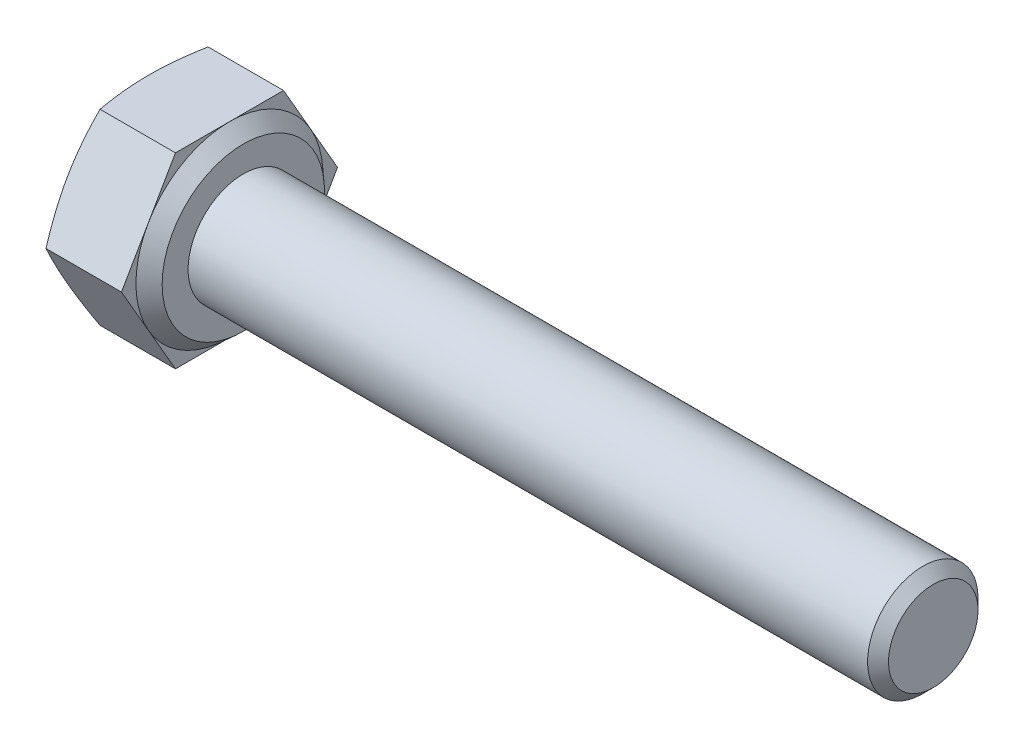
ISO-10303-21;
HEADER;
FILE_DESCRIPTION(('STEP AP214'),'2;1');
FILE_NAME('part.step','',(''),(''),'','','');
FILE_SCHEMA(('AUTOMOTIVE_DESIGN { 1 0 10303 214 1 1 1 1 }'));
ENDSEC;
DATA;
#1=APPLICATION_CONTEXT('core data for automotive mechanical design processes');
#2=APPLICATION_PROTOCOL_DEFINITION('international standard','automotive_design',2000,#1);
#3=PRODUCT_CONTEXT('',#1,'mechanical');
#4=PRODUCT('Part','Part','',(#3));
#5=PRODUCT_RELATED_PRODUCT_CATEGORY('part','',(#4));
#6=PRODUCT_DEFINITION_FORMATION('','',#4);
#7=PRODUCT_DEFINITION_CONTEXT('part definition',#1,'design');
#8=PRODUCT_DEFINITION('design','',#6,#7);
#9=PRODUCT_DEFINITION_SHAPE('','',#8);
#10=(LENGTH_UNIT() NAMED_UNIT(*) SI_UNIT(.MILLI.,.METRE.));
#11=(NAMED_UNIT(*) PLANE_ANGLE_UNIT() SI_UNIT($,.RADIAN.));
#12=(NAMED_UNIT(*) SI_UNIT($,.STERADIAN.) SOLID_ANGLE_UNIT());
#13=UNCERTAINTY_MEASURE_WITH_UNIT(LENGTH_MEASURE(1.E-05),#10,'distance_accuracy_value','');
#14=(GEOMETRIC_REPRESENTATION_CONTEXT(3) GLOBAL_UNCERTAINTY_ASSIGNED_CONTEXT((#13)) GLOBAL_UNIT_ASSIGNED_CONTEXT((#10,
#11,#12)) REPRESENTATION_CONTEXT('',''));
#15=CARTESIAN_POINT('',(0.,0.,0.));
#16=DIRECTION('',(0.,0.,1.));
#17=DIRECTION('',(1.,0.,0.));
#18=AXIS2_PLACEMENT_3D('',#15,#16,#17);
#19=CARTESIAN_POINT('',(3.425,0.,0.));
#20=DIRECTION('',(1.,0.,0.));
#21=DIRECTION('',(0.,0.,-1.));
#22=AXIS2_PLACEMENT_3D('',#19,#20,#21);
#23=PLANE('',#22);
#24=CARTESIAN_POINT('',(3.425,0.,0.));
#25=DIRECTION('',(-1.,0.,0.));
#26=DIRECTION('',(0.,0.,1.));
#27=AXIS2_PLACEMENT_3D('',#24,#25,#26);
#28=CIRCLE('',#27,2.94);
#29=CARTESIAN_POINT('',(3.425,0.,2.94));
#30=VERTEX_POINT('',#29);
#31=EDGE_CURVE('E140',#30,#30,#28,.T.);
#32=ORIENTED_EDGE('',*,*,#31,.F.);
#33=EDGE_LOOP('',(#32));
#34=FACE_BOUND('',#33,.T.);
#35=CARTESIAN_POINT('',(3.425,0.,0.));
#36=DIRECTION('',(1.,0.,0.));
#37=DIRECTION('',(0.,0.,-1.));
#38=AXIS2_PLACEMENT_3D('',#35,#36,#37);
#39=CIRCLE('',#38,2.);
#40=CARTESIAN_POINT('',(3.425,0.,-2.));
#41=VERTEX_POINT('',#40);
#42=EDGE_CURVE('E141',#41,#41,#39,.T.);
#43=ORIENTED_EDGE('',*,*,#42,.F.);
#44=EDGE_LOOP('',(#43));
#45=FACE_BOUND('',#44,.T.);
#46=ADVANCED_FACE('F36',(#34,#45),#23,.T.);
#47=CARTESIAN_POINT('',(2.925,0.,-3.91443482510566));
#48=DIRECTION('',(1.,0.,0.));
#49=DIRECTION('',(0.,0.,-1.));
#50=AXIS2_PLACEMENT_3D('',#47,#48,#49);
#51=PLANE('',#50);
#52=DIRECTION('',(0.,-0.866025403784439,0.5));
#53=VECTOR('',#52,1.);
#54=CARTESIAN_POINT('',(2.925,3.39,1.95721741255283));
#55=LINE('',#54,#53);
#56=CARTESIAN_POINT('',(2.925,3.39,1.95721741255283));
#57=VERTEX_POINT('',#56);
#58=CARTESIAN_POINT('',(2.925,1.695,2.93582611882925));
#59=VERTEX_POINT('',#58);
#60=EDGE_CURVE('E139',#57,#59,#55,.T.);
#61=ORIENTED_EDGE('',*,*,#60,.T.);
#62=CARTESIAN_POINT('',(2.925,0.,0.));
#63=DIRECTION('',(-1.,0.,0.));
#64=DIRECTION('',(0.,0.,1.));
#65=AXIS2_PLACEMENT_3D('',#62,#63,#64);
#66=CIRCLE('',#65,3.39);
#67=CARTESIAN_POINT('',(2.925,3.39,0.));
#68=VERTEX_POINT('',#67);
#69=EDGE_CURVE('E51',#59,#68,#66,.T.);
#70=ORIENTED_EDGE('',*,*,#69,.T.);
#71=DIRECTION('',(0.,0.,1.));
#72=VECTOR('',#71,1.);
#73=CARTESIAN_POINT('',(2.925,3.39,-1.95721741255283));
#74=LINE('',#73,#72);
#75=EDGE_CURVE('E136',#68,#57,#74,.T.);
#76=ORIENTED_EDGE('',*,*,#75,.T.);
#77=EDGE_LOOP('',(#61,#70,#76));
#78=FACE_BOUND('',#77,.T.);
#79=ADVANCED_FACE('F135',(#78),#51,.T.);
#80=CARTESIAN_POINT('',(2.925,3.39,-1.95721741255283));
#81=VERTEX_POINT('',#80);
#82=EDGE_CURVE('E147',#81,#68,#74,.T.);
#83=ORIENTED_EDGE('',*,*,#82,.T.);
#84=CARTESIAN_POINT('',(2.925,1.695,-2.93582611882924));
#85=VERTEX_POINT('',#84);
#86=EDGE_CURVE('E124',#68,#85,#66,.T.);
#87=ORIENTED_EDGE('',*,*,#86,.T.);
#88=DIRECTION('',(0.,0.866025403784438,0.5));
#89=VECTOR('',#88,1.);
#90=CARTESIAN_POINT('',(2.925,0.,-3.91443482510566));
#91=LINE('',#90,#89);
#92=EDGE_CURVE('E153',#85,#81,#91,.T.);
#93=ORIENTED_EDGE('',*,*,#92,.T.);
#94=EDGE_LOOP('',(#83,#87,#93));
#95=FACE_BOUND('',#94,.T.);
#96=ADVANCED_FACE('F152',(#95),#51,.T.);
#97=CARTESIAN_POINT('',(2.925,0.,-3.91443482510566));
#98=VERTEX_POINT('',#97);
#99=EDGE_CURVE('E150',#98,#85,#91,.T.);
#100=ORIENTED_EDGE('',*,*,#99,.T.);
#101=CARTESIAN_POINT('',(2.925,-1.695,-2.93582611882924));
#102=VERTEX_POINT('',#101);
#103=EDGE_CURVE('E127',#85,#102,#66,.T.);
#104=ORIENTED_EDGE('',*,*,#103,.T.);
#105=DIRECTION('',(0.,0.866025403784439,-0.5));
#106=VECTOR('',#105,1.);
#107=CARTESIAN_POINT('',(2.925,-3.39,-1.95721741255283));
#108=LINE('',#107,#106);
#109=EDGE_CURVE('E298',#102,#98,#108,.T.);
#110=ORIENTED_EDGE('',*,*,#109,.T.);
#111=EDGE_LOOP('',(#100,#104,#110));
#112=FACE_BOUND('',#111,.T.);
#113=ADVANCED_FACE('F442',(#112),#51,.T.);
#114=CARTESIAN_POINT('',(2.925,-3.39,-1.95721741255283));
#115=VERTEX_POINT('',#114);
#116=EDGE_CURVE('E296',#115,#102,#108,.T.);
#117=ORIENTED_EDGE('',*,*,#116,.T.);
#118=CARTESIAN_POINT('',(2.925,-3.39,0.));
#119=VERTEX_POINT('',#118);
#120=EDGE_CURVE('E366',#102,#119,#66,.T.);
#121=ORIENTED_EDGE('',*,*,#120,.T.);
#122=DIRECTION('',(0.,0.,-1.));
#123=VECTOR('',#122,1.);
#124=CARTESIAN_POINT('',(2.925,-3.39,1.95721741255283));
#125=LINE('',#124,#123);
#126=EDGE_CURVE('E164',#119,#115,#125,.T.);
#127=ORIENTED_EDGE('',*,*,#126,.T.);
#128=EDGE_LOOP('',(#117,#121,#127));
#129=FACE_BOUND('',#128,.T.);
#130=ADVANCED_FACE('F450',(#129),#51,.T.);
#131=CARTESIAN_POINT('',(2.925,-3.39,1.95721741255283));
#132=VERTEX_POINT('',#131);
#133=EDGE_CURVE('E165',#132,#119,#125,.T.);
#134=ORIENTED_EDGE('',*,*,#133,.T.);
#135=CARTESIAN_POINT('',(2.925,-1.695,2.93582611882925));
#136=VERTEX_POINT('',#135);
#137=EDGE_CURVE('E365',#119,#136,#66,.T.);
#138=ORIENTED_EDGE('',*,*,#137,.T.);
#139=DIRECTION('',(0.,-0.866025403784438,-0.5));
#140=VECTOR('',#139,1.);
#141=CARTESIAN_POINT('',(2.925,0.,3.91443482510566));
#142=LINE('',#141,#140);
#143=EDGE_CURVE('E160',#136,#132,#142,.T.);
#144=ORIENTED_EDGE('',*,*,#143,.T.);
#145=EDGE_LOOP('',(#134,#138,#144));
#146=FACE_BOUND('',#145,.T.);
#147=ADVANCED_FACE('F280',(#146),#51,.T.);
#148=CARTESIAN_POINT('',(2.925,0.,3.91443482510566));
#149=VERTEX_POINT('',#148);
#150=EDGE_CURVE('E161',#149,#136,#142,.T.);
#151=ORIENTED_EDGE('',*,*,#150,.T.);
#152=EDGE_CURVE('E142',#136,#59,#66,.T.);
#153=ORIENTED_EDGE('',*,*,#152,.T.);
#154=EDGE_CURVE('E155',#59,#149,#55,.T.);
#155=ORIENTED_EDGE('',*,*,#154,.T.);
#156=EDGE_LOOP('',(#151,#153,#155));
#157=FACE_BOUND('',#156,.T.);
#158=ADVANCED_FACE('F207',(#157),#51,.T.);
#159=CARTESIAN_POINT('',(2.925,-3.39,-1.95721741255283));
#160=DIRECTION('',(0.,0.5,0.866025403784439));
#161=DIRECTION('',(0.,-0.866025403784439,0.5));
#162=AXIS2_PLACEMENT_3D('',#159,#160,#161);
#163=PLANE('',#162);
#164=CARTESIAN_POINT('',(0.19092069567318,0.000199999999998237,-3.9145502951595));
#165=CARTESIAN_POINT('',(0.161404170530893,-0.140203810950536,-3.83348811711196));
#166=CARTESIAN_POINT('',(0.134553686064011,-0.281070641113377,-3.75215861479755));
#167=CARTESIAN_POINT('',(0.0873142945927171,-0.563720316746575,-3.58897074848437));
#168=CARTESIAN_POINT('',(0.0669304448507094,-0.705503791101432,-3.50711202139895));
#169=CARTESIAN_POINT('',(0.0339601092717276,-0.98841313309857,-3.34377423664064));
#170=CARTESIAN_POINT('',(0.0213017035221371,-1.12953253845124,-3.2622989099724));
#171=CARTESIAN_POINT('',(0.00432321252371375,-1.41210139168609,-3.09915770649266));
#172=CARTESIAN_POINT('',(0.,-1.55355069584304,-3.01749191266095));
#173=CARTESIAN_POINT('',(0.,-1.83644930415696,-2.85416032499754));
#174=CARTESIAN_POINT('',(0.00432321252371351,-1.97789860831391,-2.77249453116584));
#175=CARTESIAN_POINT('',(0.0213017035221369,-2.26046746154876,-2.6093533276861));
#176=CARTESIAN_POINT('',(0.0339601092717276,-2.40158686690143,-2.52787800101785));
#177=CARTESIAN_POINT('',(0.0669304448507093,-2.68449620889857,-2.36454021625954));
#178=CARTESIAN_POINT('',(0.0873142945927168,-2.82627968325342,-2.28268148917413));
#179=CARTESIAN_POINT('',(0.13455368606401,-3.10892935888662,-2.11949362286094));
#180=CARTESIAN_POINT('',(0.161404170530893,-3.24979618904946,-2.03816412054653));
#181=CARTESIAN_POINT('',(0.19092069567318,-3.3902,-1.95710194249899));
#182=B_SPLINE_CURVE_WITH_KNOTS('',3,(#164,#165,#166,#167,#168,#169,#170,#171,#172,#173,#174,
#175,#176,#177,#178,#179,#180,#181),.UNSPECIFIED.,.F.,.F.,(4,2,2,2,2,2,2,2,4),(0.,
0.494419076649431,0.989223868307328,1.47934907283627,1.96929035184584,2.45923163085541,
2.94935683538434,3.44416162704224,3.93858070369167),.UNSPECIFIED.);
#183=CARTESIAN_POINT('',(0.190878666151058,0.,-3.91443482510566));
#184=VERTEX_POINT('',#183);
#185=CARTESIAN_POINT('',(0.,-1.695,-2.93582611882925));
#186=VERTEX_POINT('',#185);
#187=EDGE_CURVE('E286',#184,#186,#182,.T.);
#188=ORIENTED_EDGE('',*,*,#187,.F.);
#189=DIRECTION('',(-1.,0.,0.));
#190=VECTOR('',#189,1.);
#191=CARTESIAN_POINT('',(2.925,0.,-3.91443482510566));
#192=LINE('',#191,#190);
#193=EDGE_CURVE('E180',#98,#184,#192,.T.);
#194=ORIENTED_EDGE('',*,*,#193,.F.);
#195=ORIENTED_EDGE('',*,*,#109,.F.);
#196=ORIENTED_EDGE('',*,*,#116,.F.);
#197=DIRECTION('',(-1.,0.,0.));
#198=VECTOR('',#197,1.);
#199=CARTESIAN_POINT('',(2.925,-3.39,-1.95721741255283));
#200=LINE('',#199,#198);
#201=CARTESIAN_POINT('',(0.190878666151058,-3.39,-1.95721741255283));
#202=VERTEX_POINT('',#201);
#203=EDGE_CURVE('E168',#115,#202,#200,.T.);
#204=ORIENTED_EDGE('',*,*,#203,.T.);
#205=EDGE_CURVE('E242',#186,#202,#182,.T.);
#206=ORIENTED_EDGE('',*,*,#205,.F.);
#207=EDGE_LOOP('',(#188,#194,#195,#196,#204,#206));
#208=FACE_BOUND('',#207,.T.);
#209=ADVANCED_FACE('F271',(#208),#163,.F.);
#210=CARTESIAN_POINT('',(2.925,0.,-3.91443482510566));
#211=DIRECTION('',(0.,-0.5,0.866025403784439));
#212=DIRECTION('',(0.,-0.866025403784439,-0.5));
#213=AXIS2_PLACEMENT_3D('',#210,#211,#212);
#214=PLANE('',#213);
#215=CARTESIAN_POINT('',(0.19092069567318,3.3902,-1.95710194249899));
#216=CARTESIAN_POINT('',(0.161404170530893,3.24979618904947,-2.03816412054653));
#217=CARTESIAN_POINT('',(0.13455368606401,3.10892935888663,-2.11949362286093));
#218=CARTESIAN_POINT('',(0.0873142945927164,2.82627968325343,-2.28268148917412));
#219=CARTESIAN_POINT('',(0.0669304448507087,2.68449620889857,-2.36454021625954));
#220=CARTESIAN_POINT('',(0.0339601092717269,2.40158686690143,-2.52787800101785));
#221=CARTESIAN_POINT('',(0.0213017035221362,2.26046746154876,-2.60935332768609));
#222=CARTESIAN_POINT('',(0.00432321252371283,1.97789860831391,-2.77249453116583));
#223=CARTESIAN_POINT('',(0.,1.83644930415696,-2.85416032499754));
#224=CARTESIAN_POINT('',(0.,1.55355069584304,-3.01749191266095));
#225=CARTESIAN_POINT('',(0.00432321252371281,1.41210139168608,-3.09915770649265));
#226=CARTESIAN_POINT('',(0.0213017035221364,1.12953253845124,-3.26229890997239));
#227=CARTESIAN_POINT('',(0.0339601092717271,0.988413133098568,-3.34377423664064));
#228=CARTESIAN_POINT('',(0.0669304448507091,0.705503791101429,-3.50711202139895));
#229=CARTESIAN_POINT('',(0.0873142945927168,0.563720316746572,-3.58897074848437));
#230=CARTESIAN_POINT('',(0.134553686064011,0.281070641113373,-3.75215861479755));
#231=CARTESIAN_POINT('',(0.161404170530893,0.140203810950531,-3.83348811711196));
#232=CARTESIAN_POINT('',(0.19092069567318,-0.000200000000002895,-3.9145502951595));
#233=B_SPLINE_CURVE_WITH_KNOTS('',3,(#215,#216,#217,#218,#219,#220,#221,#222,#223,#224,#225,
#226,#227,#228,#229,#230,#231,#232),.UNSPECIFIED.,.F.,.F.,(4,2,2,2,2,2,2,2,4),(0.,
0.494419076649433,0.989223868307331,1.47934907283627,1.96929035184584,2.45923163085541,
2.94935683538435,3.44416162704225,3.93858070369168),.UNSPECIFIED.);
#234=CARTESIAN_POINT('',(0.190878666151058,3.39,-1.95721741255283));
#235=VERTEX_POINT('',#234);
#236=CARTESIAN_POINT('',(0.,1.695,-2.93582611882925));
#237=VERTEX_POINT('',#236);
#238=EDGE_CURVE('E261',#235,#237,#233,.T.);
#239=ORIENTED_EDGE('',*,*,#238,.F.);
#240=DIRECTION('',(-1.,0.,0.));
#241=VECTOR('',#240,1.);
#242=CARTESIAN_POINT('',(2.925,3.39,-1.95721741255283));
#243=LINE('',#242,#241);
#244=EDGE_CURVE('E178',#81,#235,#243,.T.);
#245=ORIENTED_EDGE('',*,*,#244,.F.);
#246=ORIENTED_EDGE('',*,*,#92,.F.);
#247=ORIENTED_EDGE('',*,*,#99,.F.);
#248=ORIENTED_EDGE('',*,*,#193,.T.);
#249=EDGE_CURVE('E255',#237,#184,#233,.T.);
#250=ORIENTED_EDGE('',*,*,#249,.F.);
#251=EDGE_LOOP('',(#239,#245,#246,#247,#248,#250));
#252=FACE_BOUND('',#251,.T.);
#253=ADVANCED_FACE('F268',(#252),#214,.F.);
#254=CARTESIAN_POINT('',(2.925,3.39,-1.95721741255283));
#255=DIRECTION('',(0.,-1.,0.));
#256=DIRECTION('',(0.,0.,-1.));
#257=AXIS2_PLACEMENT_3D('',#254,#255,#256);
#258=PLANE('',#257);
#259=CARTESIAN_POINT('',(1.01998007678603,3.39,-5.18202410509163));
#260=CARTESIAN_POINT('',(0.973277176762849,3.39,-5.02864822170093));
#261=CARTESIAN_POINT('',(0.927119238703086,3.39,-4.87510331247702));
#262=CARTESIAN_POINT('',(0.836194758716783,3.39,-4.56758939034286));
#263=CARTESIAN_POINT('',(0.791428326892078,3.39,-4.41362034491715));
#264=CARTESIAN_POINT('',(0.703513863025892,3.39,-4.10490856376806));
#265=CARTESIAN_POINT('',(0.660369006348904,3.39,-3.95016492050158));
#266=CARTESIAN_POINT('',(0.576202801499939,3.39,-3.64010200507502));
#267=CARTESIAN_POINT('',(0.535181415200553,3.39,-3.48478274330399));
#268=CARTESIAN_POINT('',(0.456277510762571,3.39,-3.17538445925163));
#269=CARTESIAN_POINT('',(0.418362526901898,3.39,-3.02131375772906));
#270=CARTESIAN_POINT('',(0.345760529790442,3.39,-2.71240553569116));
#271=CARTESIAN_POINT('',(0.311073573864593,3.39,-2.55756800160945));
#272=CARTESIAN_POINT('',(0.245736758765148,3.39,-2.24709346969778));
#273=CARTESIAN_POINT('',(0.215085474425352,3.39,-2.09145677436788));
#274=CARTESIAN_POINT('',(0.158752164667212,3.39,-1.77927622101427));
#275=CARTESIAN_POINT('',(0.133070087160045,3.39,-1.62273237251735));
#276=CARTESIAN_POINT('',(0.0902615585085234,3.39,-1.32636324528639));
#277=CARTESIAN_POINT('',(0.0724987937850393,3.39,-1.18663074229099));
#278=CARTESIAN_POINT('',(0.0424324935505409,3.39,-0.906588726653334));
#279=CARTESIAN_POINT('',(0.0301282586295304,3.39,-0.766279290261009));
#280=CARTESIAN_POINT('',(0.0115684732453399,3.39,-0.485347279440111));
#281=CARTESIAN_POINT('',(0.00530894293677108,3.39,-0.344724972229403));
#282=CARTESIAN_POINT('',(-0.000843429893424787,3.39,-0.0633396783863417));
#283=CARTESIAN_POINT('',(-0.000736317375712136,3.39,0.0774233072455338));
#284=CARTESIAN_POINT('',(0.00585535566267225,3.39,0.359511701306452));
#285=CARTESIAN_POINT('',(0.0123722567361658,3.39,0.500836341612032));
#286=CARTESIAN_POINT('',(0.0314839470111367,3.39,0.783070380716629));
#287=CARTESIAN_POINT('',(0.0440788822329281,3.39,0.923979769457702));
#288=CARTESIAN_POINT('',(0.0747561485744432,3.39,1.20531436994921));
#289=CARTESIAN_POINT('',(0.0928431929156311,3.39,1.34573906064201));
#290=CARTESIAN_POINT('',(0.133775911633325,3.39,1.62588403716584));
#291=CARTESIAN_POINT('',(0.156621611514632,3.39,1.76560431921737));
#292=CARTESIAN_POINT('',(0.233780276143634,3.39,2.19842514715554));
#293=CARTESIAN_POINT('',(0.294955918215651,3.39,2.49029882617069));
#294=CARTESIAN_POINT('',(0.429080839522651,3.39,3.0713356247522));
#295=CARTESIAN_POINT('',(0.502034359364769,3.39,3.36049772819357));
#296=CARTESIAN_POINT('',(0.655790239761747,3.39,3.93710818694566));
#297=CARTESIAN_POINT('',(0.736602633644142,3.39,4.22455384077739));
#298=CARTESIAN_POINT('',(0.903426211229647,3.39,4.79786777350773));
#299=CARTESIAN_POINT('',(0.989436570048688,3.39,5.08373629487058));
#300=CARTESIAN_POINT('',(1.16408502975736,3.39,5.6512119864741));
#301=CARTESIAN_POINT('',(1.25268364694426,3.39,5.93283136428859));
#302=CARTESIAN_POINT('',(1.43239750842414,3.39,6.4952782028476));
#303=CARTESIAN_POINT('',(1.52351287346205,3.39,6.77610562488196));
#304=CARTESIAN_POINT('',(1.70722880846129,3.39,7.33609271380948));
#305=CARTESIAN_POINT('',(1.79982243124751,3.39,7.61525466565295));
#306=CARTESIAN_POINT('',(1.98639796935143,3.39,8.17308908237733));
#307=CARTESIAN_POINT('',(2.08037976969451,3.39,8.45176158568092));
#308=CARTESIAN_POINT('',(2.17484722699178,3.39,8.73026698474741));
#309=B_SPLINE_CURVE_WITH_KNOTS('',3,(#259,#260,#261,#262,#263,#264,#265,#266,#267,#268,#269,
#270,#271,#272,#273,#274,#275,#276,#277,#278,#279,#280,#281,#282,#283,#284,#285,#286,#287,#288,
#289,#290,#291,#292,#293,#294,#295,#296,#297,#298,#299,#300,#301,#302,#303,#304,#305,#306,#307,
#308),.UNSPECIFIED.,.F.,.F.,(4,2,2,2,2,2,2,2,2,2,2,2,2,2,2,2,2,2,2,2,2,2,2,2,4),(0.,
0.480989792271754,0.962017546102267,1.44394277803494,1.92585935388377,2.40183391785973,
2.87781693281759,3.35363140461836,3.82944088850869,4.25191903672504,4.6743430365068,
5.09648872148724,5.5186314253131,5.94291503117237,6.36720883064168,6.79186778486698,
7.21652901518068,8.11074158336345,9.00527683242142,9.90096950308116,10.7965204043521,
11.6821863327967,12.5678948265152,13.4502426356523,14.3325177703547),.UNSPECIFIED.);
#310=CARTESIAN_POINT('',(0.190878666151058,3.39,1.95721741255283));
#311=VERTEX_POINT('',#310);
#312=CARTESIAN_POINT('',(0.,3.39,0.));
#313=VERTEX_POINT('',#312);
#314=EDGE_CURVE('E59',#311,#313,#309,.F.);
#315=ORIENTED_EDGE('',*,*,#314,.F.);
#316=DIRECTION('',(-1.,0.,0.));
#317=VECTOR('',#316,1.);
#318=CARTESIAN_POINT('',(2.925,3.39,1.95721741255283));
#319=LINE('',#318,#317);
#320=EDGE_CURVE('E149',#57,#311,#319,.T.);
#321=ORIENTED_EDGE('',*,*,#320,.F.);
#322=ORIENTED_EDGE('',*,*,#75,.F.);
#323=ORIENTED_EDGE('',*,*,#82,.F.);
#324=ORIENTED_EDGE('',*,*,#244,.T.);
#325=EDGE_CURVE('E262',#313,#235,#309,.F.);
#326=ORIENTED_EDGE('',*,*,#325,.F.);
#327=EDGE_LOOP('',(#315,#321,#322,#323,#324,#326));
#328=FACE_BOUND('',#327,.T.);
#329=ADVANCED_FACE('F145',(#328),#258,.F.);
#330=CARTESIAN_POINT('',(2.925,3.39,1.95721741255283));
#331=DIRECTION('',(0.,-0.5,-0.866025403784439));
#332=DIRECTION('',(0.,0.866025403784439,-0.5));
#333=AXIS2_PLACEMENT_3D('',#330,#331,#332);
#334=PLANE('',#333);
#335=CARTESIAN_POINT('',(0.19092069567318,-0.000199999999998744,3.9145502951595));
#336=CARTESIAN_POINT('',(0.161404170530893,0.140203810950535,3.83348811711196));
#337=CARTESIAN_POINT('',(0.134553686064011,0.281070641113377,3.75215861479756));
#338=CARTESIAN_POINT('',(0.0873142945927172,0.563720316746575,3.58897074848437));
#339=CARTESIAN_POINT('',(0.0669304448507095,0.705503791101432,3.50711202139895));
#340=CARTESIAN_POINT('',(0.0339601092717276,0.988413133098571,3.34377423664064));
#341=CARTESIAN_POINT('',(0.021301703522137,1.12953253845124,3.2622989099724));
#342=CARTESIAN_POINT('',(0.00432321252371363,1.41210139168609,3.09915770649266));
#343=CARTESIAN_POINT('',(0.,1.55355069584304,3.01749191266095));
#344=CARTESIAN_POINT('',(0.,1.83644930415696,2.85416032499754));
#345=CARTESIAN_POINT('',(0.00432321252371371,1.97789860831392,2.77249453116584));
#346=CARTESIAN_POINT('',(0.0213017035221372,2.26046746154876,2.6093533276861));
#347=CARTESIAN_POINT('',(0.0339601092717279,2.40158686690143,2.52787800101785));
#348=CARTESIAN_POINT('',(0.0669304448507097,2.68449620889857,2.36454021625955));
#349=CARTESIAN_POINT('',(0.0873142945927174,2.82627968325343,2.28268148917413));
#350=CARTESIAN_POINT('',(0.134553686064011,3.10892935888663,2.11949362286094));
#351=CARTESIAN_POINT('',(0.161404170530894,3.24979618904947,2.03816412054654));
#352=CARTESIAN_POINT('',(0.190920695673181,3.3902,1.95710194249899));
#353=B_SPLINE_CURVE_WITH_KNOTS('',3,(#335,#336,#337,#338,#339,#340,#341,#342,#343,#344,#345,
#346,#347,#348,#349,#350,#351,#352),.UNSPECIFIED.,.F.,.F.,(4,2,2,2,2,2,2,2,4),(0.,
0.494419076649432,0.989223868307329,1.47934907283627,1.96929035184584,2.45923163085541,
2.94935683538435,3.44416162704224,3.93858070369168),.UNSPECIFIED.);
#354=CARTESIAN_POINT('',(0.190878666151059,0.,3.91443482510567));
#355=VERTEX_POINT('',#354);
#356=CARTESIAN_POINT('',(0.,1.695,2.93582611882925));
#357=VERTEX_POINT('',#356);
#358=EDGE_CURVE('E248',#355,#357,#353,.T.);
#359=ORIENTED_EDGE('',*,*,#358,.F.);
#360=DIRECTION('',(-1.,0.,0.));
#361=VECTOR('',#360,1.);
#362=CARTESIAN_POINT('',(2.925,0.,3.91443482510566));
#363=LINE('',#362,#361);
#364=EDGE_CURVE('E174',#149,#355,#363,.T.);
#365=ORIENTED_EDGE('',*,*,#364,.F.);
#366=ORIENTED_EDGE('',*,*,#154,.F.);
#367=ORIENTED_EDGE('',*,*,#60,.F.);
#368=ORIENTED_EDGE('',*,*,#320,.T.);
#369=EDGE_CURVE('E302',#357,#311,#353,.T.);
#370=ORIENTED_EDGE('',*,*,#369,.F.);
#371=EDGE_LOOP('',(#359,#365,#366,#367,#368,#370));
#372=FACE_BOUND('',#371,.T.);
#373=ADVANCED_FACE('F351',(#372),#334,.F.);
#374=CARTESIAN_POINT('',(2.925,0.,3.91443482510566));
#375=DIRECTION('',(0.,0.5,-0.866025403784439));
#376=DIRECTION('',(0.,0.866025403784439,0.5));
#377=AXIS2_PLACEMENT_3D('',#374,#375,#376);
#378=PLANE('',#377);
#379=CARTESIAN_POINT('',(0.19092069567318,-3.3902,1.95710194249899));
#380=CARTESIAN_POINT('',(0.161404170530893,-3.24979618904946,2.03816412054653));
#381=CARTESIAN_POINT('',(0.13455368606401,-3.10892935888662,2.11949362286094));
#382=CARTESIAN_POINT('',(0.0873142945927164,-2.82627968325342,2.28268148917413));
#383=CARTESIAN_POINT('',(0.0669304448507087,-2.68449620889857,2.36454021625954));
#384=CARTESIAN_POINT('',(0.033960109271727,-2.40158686690143,2.52787800101785));
#385=CARTESIAN_POINT('',(0.0213017035221364,-2.26046746154876,2.6093533276861));
#386=CARTESIAN_POINT('',(0.00432321252371299,-1.97789860831391,2.77249453116584));
#387=CARTESIAN_POINT('',(0.,-1.83644930415696,2.85416032499754));
#388=CARTESIAN_POINT('',(0.,-1.55355069584304,3.01749191266095));
#389=CARTESIAN_POINT('',(0.00432321252371318,-1.41210139168608,3.09915770649266));
#390=CARTESIAN_POINT('',(0.0213017035221368,-1.12953253845124,3.2622989099724));
#391=CARTESIAN_POINT('',(0.0339601092717274,-0.988413133098569,3.34377423664064));
#392=CARTESIAN_POINT('',(0.0669304448507092,-0.70550379110143,3.50711202139895));
#393=CARTESIAN_POINT('',(0.087314294592717,-0.563720316746573,3.58897074848437));
#394=CARTESIAN_POINT('',(0.134553686064011,-0.281070641113374,3.75215861479756));
#395=CARTESIAN_POINT('',(0.161404170530893,-0.140203810950533,3.83348811711196));
#396=CARTESIAN_POINT('',(0.190920695673181,0.000200000000001474,3.9145502951595));
#397=B_SPLINE_CURVE_WITH_KNOTS('',3,(#379,#380,#381,#382,#383,#384,#385,#386,#387,#388,#389,
#390,#391,#392,#393,#394,#395,#396),.UNSPECIFIED.,.F.,.F.,(4,2,2,2,2,2,2,2,4),(0.,
0.494419076649431,0.989223868307329,1.47934907283627,1.96929035184584,2.45923163085541,
2.94935683538435,3.44416162704224,3.93858070369168),.UNSPECIFIED.);
#398=CARTESIAN_POINT('',(0.190878666151058,-3.39,1.95721741255284));
#399=VERTEX_POINT('',#398);
#400=CARTESIAN_POINT('',(0.,-1.695,2.93582611882925));
#401=VERTEX_POINT('',#400);
#402=EDGE_CURVE('E234',#399,#401,#397,.T.);
#403=ORIENTED_EDGE('',*,*,#402,.F.);
#404=DIRECTION('',(-1.,0.,0.));
#405=VECTOR('',#404,1.);
#406=CARTESIAN_POINT('',(2.925,-3.39,1.95721741255283));
#407=LINE('',#406,#405);
#408=EDGE_CURVE('E171',#132,#399,#407,.T.);
#409=ORIENTED_EDGE('',*,*,#408,.F.);
#410=ORIENTED_EDGE('',*,*,#143,.F.);
#411=ORIENTED_EDGE('',*,*,#150,.F.);
#412=ORIENTED_EDGE('',*,*,#364,.T.);
#413=EDGE_CURVE('E290',#401,#355,#397,.T.);
#414=ORIENTED_EDGE('',*,*,#413,.F.);
#415=EDGE_LOOP('',(#403,#409,#410,#411,#412,#414));
#416=FACE_BOUND('',#415,.T.);
#417=ADVANCED_FACE('F347',(#416),#378,.F.);
#418=CARTESIAN_POINT('',(2.925,-3.39,1.95721741255283));
#419=DIRECTION('',(0.,1.,0.));
#420=DIRECTION('',(0.,0.,1.));
#421=AXIS2_PLACEMENT_3D('',#418,#419,#420);
#422=PLANE('',#421);
#423=CARTESIAN_POINT('',(1.01997989354759,-3.39,-5.18202350349092));
#424=CARTESIAN_POINT('',(0.97327700224221,-3.39,-5.02864764339971));
#425=CARTESIAN_POINT('',(0.927119072876942,-3.39,-4.87510275748851));
#426=CARTESIAN_POINT('',(0.8361946101753,-3.39,-4.56758888202956));
#427=CARTESIAN_POINT('',(0.791428186940743,-3.39,-4.41361985996635));
#428=CARTESIAN_POINT('',(0.703513740136748,-3.39,-4.1049081257591));
#429=CARTESIAN_POINT('',(0.660368891930328,-3.39,-3.95016450607239));
#430=CARTESIAN_POINT('',(0.576202703755944,-3.39,-3.64010163790345));
#431=CARTESIAN_POINT('',(0.535181325660586,-3.39,-3.48478239981026));
#432=CARTESIAN_POINT('',(0.456277437117914,-3.39,-3.17538416295869));
#433=CARTESIAN_POINT('',(0.41836246095362,-3.39,-3.02131348495735));
#434=CARTESIAN_POINT('',(0.345760478621676,-3.39,-2.71240531015016));
#435=CARTESIAN_POINT('',(0.31107352977889,-3.39,-2.55756779977793));
#436=CARTESIAN_POINT('',(0.245736727919532,-3.39,-2.24709331546656));
#437=CARTESIAN_POINT('',(0.215085449738308,-3.39,-2.09145664402713));
#438=CARTESIAN_POINT('',(0.158752150984605,-3.39,-1.7792761387277));
#439=CARTESIAN_POINT('',(0.133070078323605,-3.39,-1.62273231439442));
#440=CARTESIAN_POINT('',(0.090261553181781,-3.39,-1.32636320569982));
#441=CARTESIAN_POINT('',(0.0724987882413178,-3.39,-1.18663069691262));
#442=CARTESIAN_POINT('',(0.0424324881028103,-3.39,-0.906588669661413));
#443=CARTESIAN_POINT('',(0.0301282534946772,-3.39,-0.766279227447356));
#444=CARTESIAN_POINT('',(0.0115684693108643,-3.39,-0.485347204994709));
#445=CARTESIAN_POINT('',(0.00530893988923223,-3.39,-0.344724891973993));
#446=CARTESIAN_POINT('',(-0.000843430608765699,-3.39,-0.0633395865578637));
#447=CARTESIAN_POINT('',(-0.000736316645793482,-3.39,0.077423404837073));
#448=CARTESIAN_POINT('',(0.00585535977490288,-3.39,0.3595118105795));
#449=CARTESIAN_POINT('',(0.0123722627973886,-3.39,0.500836456802882));
#450=CARTESIAN_POINT('',(0.0314839573460948,-3.39,0.783070507641817));
#451=CARTESIAN_POINT('',(0.0440788948926831,-3.39,0.923979902199421));
#452=CARTESIAN_POINT('',(0.0747561661274525,-3.39,1.20531451424878));
#453=CARTESIAN_POINT('',(0.0928432130380192,-3.39,1.34573921068273));
#454=CARTESIAN_POINT('',(0.133775937021102,-3.39,1.62588419860851));
#455=CARTESIAN_POINT('',(0.156621639598423,-3.39,1.76560448632083));
#456=CARTESIAN_POINT('',(0.23378031056257,-3.39,2.19842531997452));
#457=CARTESIAN_POINT('',(0.294955955630494,-3.39,2.49029899907323));
#458=CARTESIAN_POINT('',(0.429080881996313,-3.39,3.07133579793216));
#459=CARTESIAN_POINT('',(0.502034403900263,-3.39,3.36049790156762));
#460=CARTESIAN_POINT('',(0.655790287789293,-3.39,3.9371083607067));
#461=CARTESIAN_POINT('',(0.736602683097896,-3.39,4.22455401473236));
#462=CARTESIAN_POINT('',(0.903426263150163,-3.39,4.79786794795151));
#463=CARTESIAN_POINT('',(0.989436623009947,-3.39,5.08373646960919));
#464=CARTESIAN_POINT('',(1.1640850839713,-3.39,5.65121216000975));
#465=CARTESIAN_POINT('',(1.25268370134974,-3.39,5.93283153633286));
#466=CARTESIAN_POINT('',(1.43239756302466,-3.39,6.4952783719623));
#467=CARTESIAN_POINT('',(1.52351292806605,-3.39,6.77610579255847));
#468=CARTESIAN_POINT('',(1.70722886302289,-3.39,7.33609287888208));
#469=CARTESIAN_POINT('',(1.79982248576516,-3.39,7.6152548295592));
#470=CARTESIAN_POINT('',(1.98639802369662,-3.39,8.17308924398155));
#471=CARTESIAN_POINT('',(2.08037982391118,-3.39,8.45176174614945));
#472=CARTESIAN_POINT('',(2.17484728105455,-3.39,8.73026714408879));
#473=B_SPLINE_CURVE_WITH_KNOTS('',3,(#423,#424,#425,#426,#427,#428,#429,#430,#431,#432,#433,
#434,#435,#436,#437,#438,#439,#440,#441,#442,#443,#444,#445,#446,#447,#448,#449,#450,#451,#452,
#453,#454,#455,#456,#457,#458,#459,#460,#461,#462,#463,#464,#465,#466,#467,#468,#469,#470,#471,
#472),.UNSPECIFIED.,.F.,.F.,(4,2,2,2,2,2,2,2,2,2,2,2,2,2,2,2,2,2,2,2,2,2,2,2,4),(0.,
0.480989717785643,0.96201739712082,1.44394255408912,1.92585905497698,2.40183354492129,
2.87781648583752,3.35363088376765,3.82944029381557,4.25191845933479,4.6743424764153,
5.09648817867018,5.5186308997705,5.94291452361965,6.36720834108241,6.79186731337202,
7.21652856175053,8.11074113208823,9.00527638324546,9.90096905563466,10.7965199586566,
11.6821858830082,12.5678943726271,13.4502421784021,14.3325173097535),.UNSPECIFIED.);
#474=CARTESIAN_POINT('',(0.,-3.39,0.));
#475=VERTEX_POINT('',#474);
#476=EDGE_CURVE('E310',#202,#475,#473,.T.);
#477=ORIENTED_EDGE('',*,*,#476,.F.);
#478=ORIENTED_EDGE('',*,*,#203,.F.);
#479=ORIENTED_EDGE('',*,*,#126,.F.);
#480=ORIENTED_EDGE('',*,*,#133,.F.);
#481=ORIENTED_EDGE('',*,*,#408,.T.);
#482=EDGE_CURVE('E223',#475,#399,#473,.T.);
#483=ORIENTED_EDGE('',*,*,#482,.F.);
#484=EDGE_LOOP('',(#477,#478,#479,#480,#481,#483));
#485=FACE_BOUND('',#484,.T.);
#486=ADVANCED_FACE('F344',(#485),#422,.F.);
#487=CARTESIAN_POINT('',(0.,0.,0.));
#488=DIRECTION('',(1.,0.,0.));
#489=DIRECTION('',(0.,0.,-1.));
#490=AXIS2_PLACEMENT_3D('',#487,#488,#489);
#491=CONICAL_SURFACE('',#490,3.39,1.22173047639604);
#492=ORIENTED_EDGE('',*,*,#249,.T.);
#493=ORIENTED_EDGE('',*,*,#187,.T.);
#494=CARTESIAN_POINT('',(0.,0.,0.));
#495=DIRECTION('',(1.,0.,0.));
#496=DIRECTION('',(0.,0.,-1.));
#497=AXIS2_PLACEMENT_3D('',#494,#495,#496);
#498=CIRCLE('',#497,3.39000000000001);
#499=EDGE_CURVE('E183',#186,#237,#498,.T.);
#500=ORIENTED_EDGE('',*,*,#499,.T.);
#501=EDGE_LOOP('',(#492,#493,#500));
#502=FACE_BOUND('',#501,.T.);
#503=ADVANCED_FACE('F343',(#502),#491,.T.);
#504=ORIENTED_EDGE('',*,*,#205,.T.);
#505=ORIENTED_EDGE('',*,*,#476,.T.);
#506=EDGE_CURVE('E185',#475,#186,#498,.T.);
#507=ORIENTED_EDGE('',*,*,#506,.T.);
#508=EDGE_LOOP('',(#504,#505,#507));
#509=FACE_BOUND('',#508,.T.);
#510=ADVANCED_FACE('F370',(#509),#491,.T.);
#511=ORIENTED_EDGE('',*,*,#402,.T.);
#512=EDGE_CURVE('E368',#401,#475,#498,.T.);
#513=ORIENTED_EDGE('',*,*,#512,.T.);
#514=ORIENTED_EDGE('',*,*,#482,.T.);
#515=EDGE_LOOP('',(#511,#513,#514));
#516=FACE_BOUND('',#515,.T.);
#517=ADVANCED_FACE('F218',(#516),#491,.T.);
#518=ORIENTED_EDGE('',*,*,#358,.T.);
#519=EDGE_CURVE('E367',#357,#401,#498,.T.);
#520=ORIENTED_EDGE('',*,*,#519,.T.);
#521=ORIENTED_EDGE('',*,*,#413,.T.);
#522=EDGE_LOOP('',(#518,#520,#521));
#523=FACE_BOUND('',#522,.T.);
#524=ADVANCED_FACE('F217',(#523),#491,.T.);
#525=ORIENTED_EDGE('',*,*,#314,.T.);
#526=CARTESIAN_POINT('',(0.,0.,0.));
#527=DIRECTION('',(-1.,0.,0.));
#528=DIRECTION('',(0.,0.,1.));
#529=AXIS2_PLACEMENT_3D('',#526,#527,#528);
#530=CIRCLE('',#529,3.39);
#531=EDGE_CURVE('E318',#357,#313,#530,.T.);
#532=ORIENTED_EDGE('',*,*,#531,.F.);
#533=ORIENTED_EDGE('',*,*,#369,.T.);
#534=EDGE_LOOP('',(#525,#532,#533));
#535=FACE_BOUND('',#534,.T.);
#536=ADVANCED_FACE('F213',(#535),#491,.T.);
#537=ORIENTED_EDGE('',*,*,#325,.T.);
#538=ORIENTED_EDGE('',*,*,#238,.T.);
#539=EDGE_CURVE('E186',#237,#313,#498,.T.);
#540=ORIENTED_EDGE('',*,*,#539,.T.);
#541=EDGE_LOOP('',(#537,#538,#540));
#542=FACE_BOUND('',#541,.T.);
#543=ADVANCED_FACE('F216',(#542),#491,.T.);
#544=CARTESIAN_POINT('',(0.,0.,-3.91443482510566));
#545=DIRECTION('',(1.,0.,0.));
#546=DIRECTION('',(0.,0.,-1.));
#547=AXIS2_PLACEMENT_3D('',#544,#545,#546);
#548=PLANE('',#547);
#549=ORIENTED_EDGE('',*,*,#539,.F.);
#550=ORIENTED_EDGE('',*,*,#499,.F.);
#551=ORIENTED_EDGE('',*,*,#506,.F.);
#552=ORIENTED_EDGE('',*,*,#512,.F.);
#553=ORIENTED_EDGE('',*,*,#519,.F.);
#554=ORIENTED_EDGE('',*,*,#531,.T.);
#555=EDGE_LOOP('',(#549,#550,#551,#552,#553,#554));
#556=FACE_BOUND('',#555,.T.);
#557=ADVANCED_FACE('F335',(#556),#548,.F.);
#558=CARTESIAN_POINT('',(2.925,0.,0.));
#559=DIRECTION('',(-1.,0.,0.));
#560=DIRECTION('',(0.,0.,1.));
#561=AXIS2_PLACEMENT_3D('',#558,#559,#560);
#562=CONICAL_SURFACE('',#561,3.39,0.732815101786504);
#563=ORIENTED_EDGE('',*,*,#31,.T.);
#564=EDGE_LOOP('',(#563));
#565=FACE_BOUND('',#564,.T.);
#566=ORIENTED_EDGE('',*,*,#69,.F.);
#567=ORIENTED_EDGE('',*,*,#152,.F.);
#568=ORIENTED_EDGE('',*,*,#137,.F.);
#569=ORIENTED_EDGE('',*,*,#120,.F.);
#570=ORIENTED_EDGE('',*,*,#103,.F.);
#571=ORIENTED_EDGE('',*,*,#86,.F.);
#572=EDGE_LOOP('',(#566,#567,#568,#569,#570,#571));
#573=FACE_BOUND('',#572,.T.);
#574=ADVANCED_FACE('F125',(#565,#573),#562,.T.);
#575=CARTESIAN_POINT('',(28.425,0.,0.));
#576=DIRECTION('',(-1.,0.,0.));
#577=DIRECTION('',(0.,0.,1.));
#578=AXIS2_PLACEMENT_3D('',#575,#576,#577);
#579=CYLINDRICAL_SURFACE('',#578,2.);
#580=CARTESIAN_POINT('',(28.046,0.,0.));
#581=DIRECTION('',(1.,0.,0.));
#582=DIRECTION('',(0.,0.,-1.));
#583=AXIS2_PLACEMENT_3D('',#580,#581,#582);
#584=CIRCLE('',#583,2.);
#585=CARTESIAN_POINT('',(28.046,0.,-2.));
#586=VERTEX_POINT('',#585);
#587=EDGE_CURVE('E11',#586,#586,#584,.F.);
#588=ORIENTED_EDGE('',*,*,#587,.T.);
#589=EDGE_LOOP('',(#588));
#590=FACE_BOUND('',#589,.T.);
#591=ORIENTED_EDGE('',*,*,#42,.T.);
#592=EDGE_LOOP('',(#591));
#593=FACE_BOUND('',#592,.T.);
#594=ADVANCED_FACE('F197',(#590,#593),#579,.T.);
#595=CARTESIAN_POINT('',(28.425,0.,0.));
#596=DIRECTION('',(1.,0.,0.));
#597=DIRECTION('',(0.,0.,-1.));
#598=AXIS2_PLACEMENT_3D('',#595,#596,#597);
#599=PLANE('',#598);
#600=CARTESIAN_POINT('',(28.425,0.,0.));
#601=DIRECTION('',(1.,0.,0.));
#602=DIRECTION('',(0.,0.,-1.));
#603=AXIS2_PLACEMENT_3D('',#600,#601,#602);
#604=CIRCLE('',#603,1.621);
#605=CARTESIAN_POINT('',(28.425,0.,-1.62100000000001));
#606=VERTEX_POINT('',#605);
#607=EDGE_CURVE('E44',#606,#606,#604,.T.);
#608=ORIENTED_EDGE('',*,*,#607,.T.);
#609=EDGE_LOOP('',(#608));
#610=FACE_BOUND('',#609,.T.);
#611=ADVANCED_FACE('F190',(#610),#599,.T.);
#612=CARTESIAN_POINT('',(28.425,0.,0.));
#613=DIRECTION('',(-1.,0.,0.));
#614=DIRECTION('',(0.,0.,1.));
#615=AXIS2_PLACEMENT_3D('',#612,#613,#614);
#616=CONICAL_SURFACE('',#615,1.621,0.785398163397442);
#617=ORIENTED_EDGE('',*,*,#587,.F.);
#618=EDGE_LOOP('',(#617));
#619=FACE_BOUND('',#618,.T.);
#620=ORIENTED_EDGE('',*,*,#607,.F.);
#621=EDGE_LOOP('',(#620));
#622=FACE_BOUND('',#621,.T.);
#623=ADVANCED_FACE('F38',(#619,#622),#616,.T.);
#624=CLOSED_SHELL('',(#46,#79,#96,#113,#130,#147,#158,#209,#253,#329,#373,#417,#486,#503,#510,
#517,#524,#536,#543,#557,#574,#594,#611,#623));
#625=MANIFOLD_SOLID_BREP('B2',#624);
#626=ADVANCED_BREP_SHAPE_REPRESENTATION('',(#18,#625),#14);
#627=SHAPE_DEFINITION_REPRESENTATION(#9,#626);
ENDSEC;
END-ISO-10303-21;
